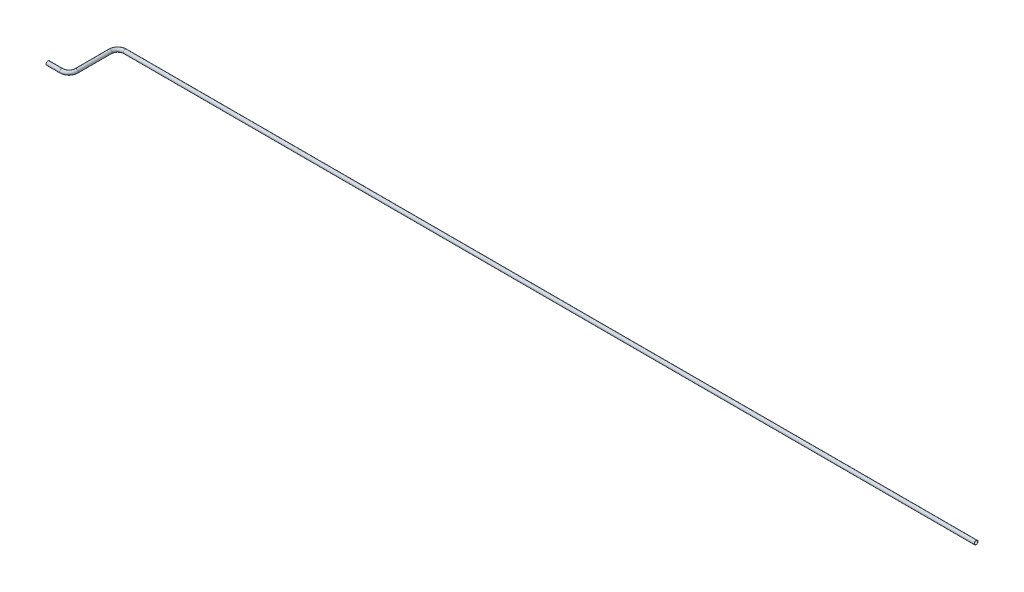
ISO-10303-21;
HEADER;
FILE_DESCRIPTION(('STEP AP214'),'2;1');
FILE_NAME('part.step','',(''),(''),'','','');
FILE_SCHEMA(('AUTOMOTIVE_DESIGN { 1 0 10303 214 1 1 1 1 }'));
ENDSEC;
DATA;
#1=APPLICATION_CONTEXT('core data for automotive mechanical design processes');
#2=APPLICATION_PROTOCOL_DEFINITION('international standard','automotive_design',2000,#1);
#3=PRODUCT_CONTEXT('',#1,'mechanical');
#4=PRODUCT('Part','Part','',(#3));
#5=PRODUCT_RELATED_PRODUCT_CATEGORY('part','',(#4));
#6=PRODUCT_DEFINITION_FORMATION('','',#4);
#7=PRODUCT_DEFINITION_CONTEXT('part definition',#1,'design');
#8=PRODUCT_DEFINITION('design','',#6,#7);
#9=PRODUCT_DEFINITION_SHAPE('','',#8);
#10=(LENGTH_UNIT() NAMED_UNIT(*) SI_UNIT(.MILLI.,.METRE.));
#11=(NAMED_UNIT(*) PLANE_ANGLE_UNIT() SI_UNIT($,.RADIAN.));
#12=(NAMED_UNIT(*) SI_UNIT($,.STERADIAN.) SOLID_ANGLE_UNIT());
#13=UNCERTAINTY_MEASURE_WITH_UNIT(LENGTH_MEASURE(1.E-05),#10,'distance_accuracy_value','');
#14=(GEOMETRIC_REPRESENTATION_CONTEXT(3) GLOBAL_UNCERTAINTY_ASSIGNED_CONTEXT((#13)) GLOBAL_UNIT_ASSIGNED_CONTEXT((#10,
#11,#12)) REPRESENTATION_CONTEXT('',''));
#15=CARTESIAN_POINT('',(0.,0.,0.));
#16=DIRECTION('',(0.,0.,1.));
#17=DIRECTION('',(1.,0.,0.));
#18=AXIS2_PLACEMENT_3D('',#15,#16,#17);
#19=CARTESIAN_POINT('',(0.,0.,0.));
#20=DIRECTION('',(1.,0.,0.));
#21=DIRECTION('',(0.,0.,-1.));
#22=AXIS2_PLACEMENT_3D('',#19,#20,#21);
#23=CYLINDRICAL_SURFACE('',#22,3.175);
#24=CARTESIAN_POINT('',(22.86,0.,0.));
#25=DIRECTION('',(1.,0.,0.));
#26=DIRECTION('',(0.,0.,-1.));
#27=AXIS2_PLACEMENT_3D('',#24,#25,#26);
#28=CIRCLE('',#27,3.175);
#29=CARTESIAN_POINT('',(22.86,0.,3.175));
#30=VERTEX_POINT('',#29);
#31=EDGE_CURVE('E60',#30,#30,#28,.T.);
#32=ORIENTED_EDGE('',*,*,#31,.F.);
#33=EDGE_LOOP('',(#32));
#34=FACE_BOUND('',#33,.T.);
#35=CARTESIAN_POINT('',(0.,0.,0.));
#36=DIRECTION('',(1.,0.,0.));
#37=DIRECTION('',(0.,0.,-1.));
#38=AXIS2_PLACEMENT_3D('',#35,#36,#37);
#39=CIRCLE('',#38,3.175);
#40=CARTESIAN_POINT('',(0.,0.,-3.175));
#41=VERTEX_POINT('',#40);
#42=EDGE_CURVE('E57',#41,#41,#39,.T.);
#43=ORIENTED_EDGE('',*,*,#42,.T.);
#44=EDGE_LOOP('',(#43));
#45=FACE_BOUND('',#44,.T.);
#46=ADVANCED_FACE('F36',(#34,#45),#23,.T.);
#47=CARTESIAN_POINT('',(22.86,0.,-12.7));
#48=DIRECTION('',(0.,1.,0.));
#49=DIRECTION('',(0.,0.,1.));
#50=AXIS2_PLACEMENT_3D('',#47,#48,#49);
#51=TOROIDAL_SURFACE('',#50,12.7,3.175);
#52=CARTESIAN_POINT('',(35.56,0.,-12.7));
#53=DIRECTION('',(0.,0.,-1.));
#54=DIRECTION('',(-1.,0.,0.));
#55=AXIS2_PLACEMENT_3D('',#52,#53,#54);
#56=CIRCLE('',#55,3.175);
#57=CARTESIAN_POINT('',(38.735,0.,-12.7));
#58=VERTEX_POINT('',#57);
#59=EDGE_CURVE('E63',#58,#58,#56,.T.);
#60=CARTESIAN_POINT('',(22.86,0.,-12.7));
#61=DIRECTION('',(0.,1.,0.));
#62=DIRECTION('',(0.,0.,1.));
#63=AXIS2_PLACEMENT_3D('',#60,#61,#62);
#64=CIRCLE('',#63,15.875);
#65=EDGE_CURVE('',#30,#58,#64,.T.);
#66=ORIENTED_EDGE('',*,*,#31,.T.);
#67=ORIENTED_EDGE('',*,*,#59,.F.);
#68=ORIENTED_EDGE('',*,*,#65,.T.);
#69=ORIENTED_EDGE('',*,*,#65,.F.);
#70=EDGE_LOOP('',(#66,#68,#67,#69));
#71=FACE_BOUND('',#70,.T.);
#72=ADVANCED_FACE('F82',(#71),#51,.T.);
#73=CARTESIAN_POINT('',(35.56,0.,-12.7));
#74=DIRECTION('',(0.,0.,-1.));
#75=DIRECTION('',(0.,1.,0.));
#76=AXIS2_PLACEMENT_3D('',#73,#74,#75);
#77=CYLINDRICAL_SURFACE('',#76,3.175);
#78=CARTESIAN_POINT('',(35.56,0.,-69.48826463));
#79=DIRECTION('',(0.,0.,-1.));
#80=DIRECTION('',(-1.,0.,0.));
#81=AXIS2_PLACEMENT_3D('',#78,#79,#80);
#82=CIRCLE('',#81,3.175);
#83=CARTESIAN_POINT('',(32.385,0.,-69.48826463));
#84=VERTEX_POINT('',#83);
#85=EDGE_CURVE('E65',#84,#84,#82,.T.);
#86=ORIENTED_EDGE('',*,*,#85,.F.);
#87=EDGE_LOOP('',(#86));
#88=FACE_BOUND('',#87,.T.);
#89=ORIENTED_EDGE('',*,*,#59,.T.);
#90=EDGE_LOOP('',(#89));
#91=FACE_BOUND('',#90,.T.);
#92=ADVANCED_FACE('F75',(#88,#91),#77,.T.);
#93=CARTESIAN_POINT('',(48.26,0.,-69.48826463));
#94=DIRECTION('',(0.,-1.,0.));
#95=DIRECTION('',(0.,0.,-1.));
#96=AXIS2_PLACEMENT_3D('',#93,#94,#95);
#97=TOROIDAL_SURFACE('',#96,12.7,3.175);
#98=CARTESIAN_POINT('',(48.26,0.,-82.18826463));
#99=DIRECTION('',(1.,0.,0.));
#100=DIRECTION('',(0.,0.,-1.));
#101=AXIS2_PLACEMENT_3D('',#98,#99,#100);
#102=CIRCLE('',#101,3.175);
#103=CARTESIAN_POINT('',(48.26,0.,-85.36326463));
#104=VERTEX_POINT('',#103);
#105=EDGE_CURVE('E40',#104,#104,#102,.T.);
#106=CARTESIAN_POINT('',(48.26,0.,-69.48826463));
#107=DIRECTION('',(0.,-1.,0.));
#108=DIRECTION('',(0.,0.,-1.));
#109=AXIS2_PLACEMENT_3D('',#106,#107,#108);
#110=CIRCLE('',#109,15.875);
#111=EDGE_CURVE('',#84,#104,#110,.T.);
#112=ORIENTED_EDGE('',*,*,#85,.T.);
#113=ORIENTED_EDGE('',*,*,#105,.F.);
#114=ORIENTED_EDGE('',*,*,#111,.T.);
#115=ORIENTED_EDGE('',*,*,#111,.F.);
#116=EDGE_LOOP('',(#112,#114,#113,#115));
#117=FACE_BOUND('',#116,.T.);
#118=ADVANCED_FACE('F73',(#117),#97,.T.);
#119=CARTESIAN_POINT('',(48.26,0.,-82.18826463));
#120=DIRECTION('',(1.,0.,0.));
#121=DIRECTION('',(0.,0.,-1.));
#122=AXIS2_PLACEMENT_3D('',#119,#120,#121);
#123=CYLINDRICAL_SURFACE('',#122,3.175);
#124=CARTESIAN_POINT('',(1483.36,0.,-82.18826463));
#125=DIRECTION('',(1.,0.,0.));
#126=DIRECTION('',(0.,0.,-1.));
#127=AXIS2_PLACEMENT_3D('',#124,#125,#126);
#128=CIRCLE('',#127,3.175);
#129=CARTESIAN_POINT('',(1483.36,0.,-85.36326463));
#130=VERTEX_POINT('',#129);
#131=EDGE_CURVE('E53',#130,#130,#128,.T.);
#132=ORIENTED_EDGE('',*,*,#131,.F.);
#133=EDGE_LOOP('',(#132));
#134=FACE_BOUND('',#133,.T.);
#135=ORIENTED_EDGE('',*,*,#105,.T.);
#136=EDGE_LOOP('',(#135));
#137=FACE_BOUND('',#136,.T.);
#138=ADVANCED_FACE('F38',(#134,#137),#123,.T.);
#139=CARTESIAN_POINT('',(0.,0.,0.));
#140=DIRECTION('',(1.,0.,0.));
#141=DIRECTION('',(0.,0.,-1.));
#142=AXIS2_PLACEMENT_3D('',#139,#140,#141);
#143=PLANE('',#142);
#144=CARTESIAN_POINT('',(0.,0.,0.));
#145=DIRECTION('',(1.,0.,0.));
#146=DIRECTION('',(0.,0.,-1.));
#147=AXIS2_PLACEMENT_3D('',#144,#145,#146);
#148=CIRCLE('',#147,2.667);
#149=CARTESIAN_POINT('',(0.,0.,-2.667));
#150=VERTEX_POINT('',#149);
#151=EDGE_CURVE('E56',#150,#150,#148,.F.);
#152=ORIENTED_EDGE('',*,*,#151,.F.);
#153=EDGE_LOOP('',(#152));
#154=FACE_BOUND('',#153,.T.);
#155=ORIENTED_EDGE('',*,*,#42,.F.);
#156=EDGE_LOOP('',(#155));
#157=FACE_BOUND('',#156,.T.);
#158=ADVANCED_FACE('F80',(#154,#157),#143,.F.);
#159=CARTESIAN_POINT('',(1483.36,0.,-82.18826463));
#160=DIRECTION('',(1.,0.,0.));
#161=DIRECTION('',(0.,0.,-1.));
#162=AXIS2_PLACEMENT_3D('',#159,#160,#161);
#163=PLANE('',#162);
#164=CARTESIAN_POINT('',(1483.36,0.,-82.18826463));
#165=DIRECTION('',(1.,0.,0.));
#166=DIRECTION('',(0.,0.,-1.));
#167=AXIS2_PLACEMENT_3D('',#164,#165,#166);
#168=CIRCLE('',#167,2.667);
#169=CARTESIAN_POINT('',(1483.36,0.,-84.85526463));
#170=VERTEX_POINT('',#169);
#171=EDGE_CURVE('E10',#170,#170,#168,.F.);
#172=ORIENTED_EDGE('',*,*,#171,.T.);
#173=EDGE_LOOP('',(#172));
#174=FACE_BOUND('',#173,.T.);
#175=ORIENTED_EDGE('',*,*,#131,.T.);
#176=EDGE_LOOP('',(#175));
#177=FACE_BOUND('',#176,.T.);
#178=ADVANCED_FACE('F99',(#174,#177),#163,.T.);
#179=CARTESIAN_POINT('',(0.,0.,0.));
#180=DIRECTION('',(1.,0.,0.));
#181=DIRECTION('',(0.,0.,-1.));
#182=AXIS2_PLACEMENT_3D('',#179,#180,#181);
#183=CYLINDRICAL_SURFACE('',#182,2.667);
#184=CARTESIAN_POINT('',(22.86,0.,0.));
#185=DIRECTION('',(1.,0.,0.));
#186=DIRECTION('',(0.,0.,-1.));
#187=AXIS2_PLACEMENT_3D('',#184,#185,#186);
#188=CIRCLE('',#187,2.667);
#189=CARTESIAN_POINT('',(22.86,0.,2.667));
#190=VERTEX_POINT('',#189);
#191=EDGE_CURVE('E196',#190,#190,#188,.F.);
#192=ORIENTED_EDGE('',*,*,#191,.F.);
#193=EDGE_LOOP('',(#192));
#194=FACE_BOUND('',#193,.T.);
#195=ORIENTED_EDGE('',*,*,#151,.T.);
#196=EDGE_LOOP('',(#195));
#197=FACE_BOUND('',#196,.T.);
#198=ADVANCED_FACE('F102',(#194,#197),#183,.F.);
#199=CARTESIAN_POINT('',(22.86,0.,-12.7));
#200=DIRECTION('',(0.,1.,0.));
#201=DIRECTION('',(0.,0.,1.));
#202=AXIS2_PLACEMENT_3D('',#199,#200,#201);
#203=TOROIDAL_SURFACE('',#202,12.7,2.667);
#204=CARTESIAN_POINT('',(35.56,0.,-12.7));
#205=DIRECTION('',(0.,0.,-1.));
#206=DIRECTION('',(-1.,0.,0.));
#207=AXIS2_PLACEMENT_3D('',#204,#205,#206);
#208=CIRCLE('',#207,2.667);
#209=CARTESIAN_POINT('',(38.227,0.,-12.7));
#210=VERTEX_POINT('',#209);
#211=EDGE_CURVE('E195',#210,#210,#208,.F.);
#212=CARTESIAN_POINT('',(22.86,0.,-12.7));
#213=DIRECTION('',(0.,1.,0.));
#214=DIRECTION('',(0.,0.,1.));
#215=AXIS2_PLACEMENT_3D('',#212,#213,#214);
#216=CIRCLE('',#215,15.367);
#217=EDGE_CURVE('',#190,#210,#216,.T.);
#218=ORIENTED_EDGE('',*,*,#191,.T.);
#219=ORIENTED_EDGE('',*,*,#211,.F.);
#220=ORIENTED_EDGE('',*,*,#217,.T.);
#221=ORIENTED_EDGE('',*,*,#217,.F.);
#222=EDGE_LOOP('',(#218,#220,#219,#221));
#223=FACE_BOUND('',#222,.T.);
#224=ADVANCED_FACE('F158',(#223),#203,.F.);
#225=CARTESIAN_POINT('',(35.56,0.,-12.7));
#226=DIRECTION('',(0.,0.,-1.));
#227=DIRECTION('',(0.,1.,0.));
#228=AXIS2_PLACEMENT_3D('',#225,#226,#227);
#229=CYLINDRICAL_SURFACE('',#228,2.667);
#230=CARTESIAN_POINT('',(35.56,0.,-69.48826463));
#231=DIRECTION('',(0.,0.,-1.));
#232=DIRECTION('',(-1.,0.,0.));
#233=AXIS2_PLACEMENT_3D('',#230,#231,#232);
#234=CIRCLE('',#233,2.667);
#235=CARTESIAN_POINT('',(32.893,0.,-69.48826463));
#236=VERTEX_POINT('',#235);
#237=EDGE_CURVE('E49',#236,#236,#234,.F.);
#238=ORIENTED_EDGE('',*,*,#237,.F.);
#239=EDGE_LOOP('',(#238));
#240=FACE_BOUND('',#239,.T.);
#241=ORIENTED_EDGE('',*,*,#211,.T.);
#242=EDGE_LOOP('',(#241));
#243=FACE_BOUND('',#242,.T.);
#244=ADVANCED_FACE('F93',(#240,#243),#229,.F.);
#245=CARTESIAN_POINT('',(48.26,0.,-69.48826463));
#246=DIRECTION('',(0.,-1.,0.));
#247=DIRECTION('',(0.,0.,-1.));
#248=AXIS2_PLACEMENT_3D('',#245,#246,#247);
#249=TOROIDAL_SURFACE('',#248,12.7,2.667);
#250=CARTESIAN_POINT('',(48.26,0.,-82.18826463));
#251=DIRECTION('',(1.,0.,0.));
#252=DIRECTION('',(0.,0.,-1.));
#253=AXIS2_PLACEMENT_3D('',#250,#251,#252);
#254=CIRCLE('',#253,2.667);
#255=CARTESIAN_POINT('',(48.26,0.,-84.85526463));
#256=VERTEX_POINT('',#255);
#257=EDGE_CURVE('E44',#256,#256,#254,.F.);
#258=CARTESIAN_POINT('',(48.26,0.,-69.48826463));
#259=DIRECTION('',(0.,-1.,0.));
#260=DIRECTION('',(0.,0.,-1.));
#261=AXIS2_PLACEMENT_3D('',#258,#259,#260);
#262=CIRCLE('',#261,15.367);
#263=EDGE_CURVE('',#236,#256,#262,.T.);
#264=ORIENTED_EDGE('',*,*,#237,.T.);
#265=ORIENTED_EDGE('',*,*,#257,.F.);
#266=ORIENTED_EDGE('',*,*,#263,.T.);
#267=ORIENTED_EDGE('',*,*,#263,.F.);
#268=EDGE_LOOP('',(#264,#266,#265,#267));
#269=FACE_BOUND('',#268,.T.);
#270=ADVANCED_FACE('F87',(#269),#249,.F.);
#271=CARTESIAN_POINT('',(48.26,0.,-82.18826463));
#272=DIRECTION('',(1.,0.,0.));
#273=DIRECTION('',(0.,0.,-1.));
#274=AXIS2_PLACEMENT_3D('',#271,#272,#273);
#275=CYLINDRICAL_SURFACE('',#274,2.667);
#276=ORIENTED_EDGE('',*,*,#171,.F.);
#277=EDGE_LOOP('',(#276));
#278=FACE_BOUND('',#277,.T.);
#279=ORIENTED_EDGE('',*,*,#257,.T.);
#280=EDGE_LOOP('',(#279));
#281=FACE_BOUND('',#280,.T.);
#282=ADVANCED_FACE('F85',(#278,#281),#275,.F.);
#283=CLOSED_SHELL('',(#46,#72,#92,#118,#138,#158,#178,#198,#224,#244,#270,#282));
#284=MANIFOLD_SOLID_BREP('B2',#283);
#285=ADVANCED_BREP_SHAPE_REPRESENTATION('',(#18,#284),#14);
#286=SHAPE_DEFINITION_REPRESENTATION(#9,#285);
ENDSEC;
END-ISO-10303-21;
